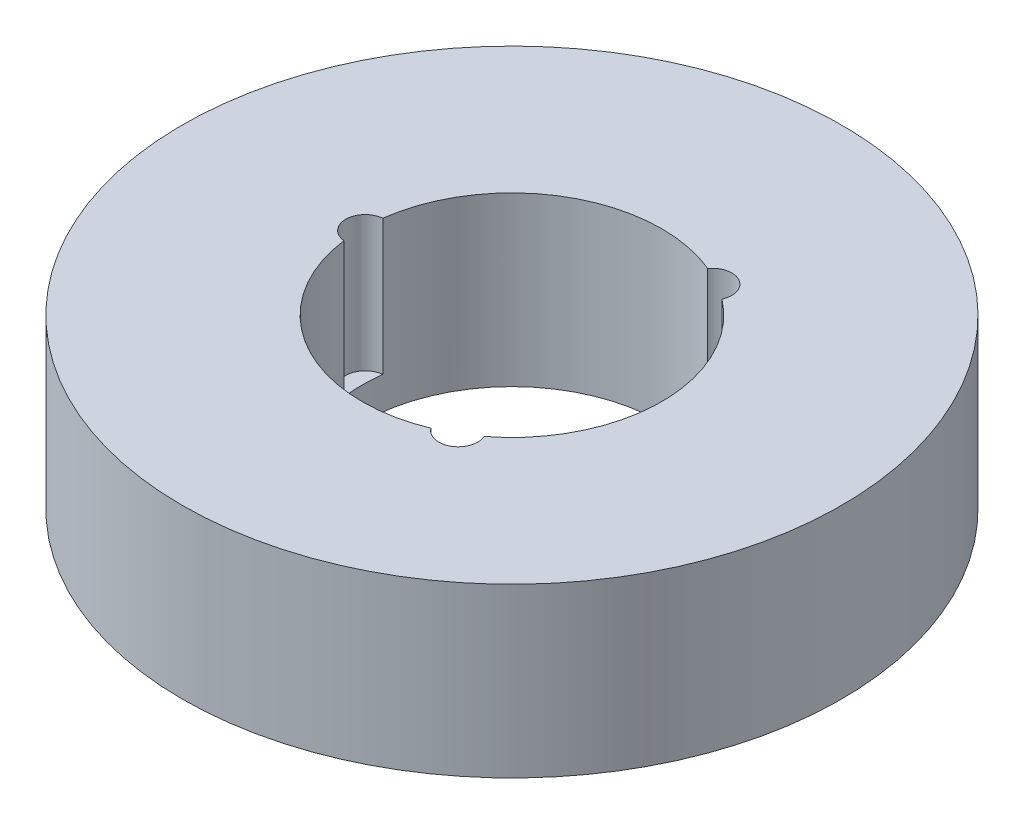
ISO-10303-21;
HEADER;
FILE_DESCRIPTION(('STEP AP214'),'2;1');
FILE_NAME('part.step','',(''),(''),'','','');
FILE_SCHEMA(('AUTOMOTIVE_DESIGN { 1 0 10303 214 1 1 1 1 }'));
ENDSEC;
DATA;
#1=APPLICATION_CONTEXT('core data for automotive mechanical design processes');
#2=APPLICATION_PROTOCOL_DEFINITION('international standard','automotive_design',2000,#1);
#3=PRODUCT_CONTEXT('',#1,'mechanical');
#4=PRODUCT('Part','Part','',(#3));
#5=PRODUCT_RELATED_PRODUCT_CATEGORY('part','',(#4));
#6=PRODUCT_DEFINITION_FORMATION('','',#4);
#7=PRODUCT_DEFINITION_CONTEXT('part definition',#1,'design');
#8=PRODUCT_DEFINITION('design','',#6,#7);
#9=PRODUCT_DEFINITION_SHAPE('','',#8);
#10=(LENGTH_UNIT() NAMED_UNIT(*) SI_UNIT(.MILLI.,.METRE.));
#11=(NAMED_UNIT(*) PLANE_ANGLE_UNIT() SI_UNIT($,.RADIAN.));
#12=(NAMED_UNIT(*) SI_UNIT($,.STERADIAN.) SOLID_ANGLE_UNIT());
#13=UNCERTAINTY_MEASURE_WITH_UNIT(LENGTH_MEASURE(1.E-05),#10,'distance_accuracy_value','');
#14=(GEOMETRIC_REPRESENTATION_CONTEXT(3) GLOBAL_UNCERTAINTY_ASSIGNED_CONTEXT((#13)) GLOBAL_UNIT_ASSIGNED_CONTEXT((#10,
#11,#12)) REPRESENTATION_CONTEXT('',''));
#15=CARTESIAN_POINT('',(0.,0.,0.));
#16=DIRECTION('',(0.,0.,1.));
#17=DIRECTION('',(1.,0.,0.));
#18=AXIS2_PLACEMENT_3D('',#15,#16,#17);
#19=CARTESIAN_POINT('',(0.,28.,0.));
#20=DIRECTION('',(0.,-1.,0.));
#21=DIRECTION('',(0.,0.,-1.));
#22=AXIS2_PLACEMENT_3D('',#19,#20,#21);
#23=CYLINDRICAL_SURFACE('',#22,55.);
#24=CARTESIAN_POINT('',(0.,28.,0.));
#25=DIRECTION('',(0.,1.,0.));
#26=DIRECTION('',(0.,0.,1.));
#27=AXIS2_PLACEMENT_3D('',#24,#25,#26);
#28=CIRCLE('',#27,55.);
#29=CARTESIAN_POINT('',(0.,28.,55.));
#30=VERTEX_POINT('',#29);
#31=EDGE_CURVE('E130',#30,#30,#28,.T.);
#32=ORIENTED_EDGE('',*,*,#31,.F.);
#33=EDGE_LOOP('',(#32));
#34=FACE_BOUND('',#33,.T.);
#35=CARTESIAN_POINT('',(0.,0.,0.));
#36=DIRECTION('',(0.,1.,0.));
#37=DIRECTION('',(0.,0.,1.));
#38=AXIS2_PLACEMENT_3D('',#35,#36,#37);
#39=CIRCLE('',#38,55.);
#40=CARTESIAN_POINT('',(0.,0.,55.));
#41=VERTEX_POINT('',#40);
#42=EDGE_CURVE('E117',#41,#41,#39,.T.);
#43=ORIENTED_EDGE('',*,*,#42,.T.);
#44=EDGE_LOOP('',(#43));
#45=FACE_BOUND('',#44,.T.);
#46=ADVANCED_FACE('F39',(#34,#45),#23,.T.);
#47=CARTESIAN_POINT('',(0.,28.,0.));
#48=DIRECTION('',(0.,1.,0.));
#49=DIRECTION('',(0.,0.,1.));
#50=AXIS2_PLACEMENT_3D('',#47,#48,#49);
#51=PLANE('',#50);
#52=CARTESIAN_POINT('',(12.2413409915985,28.,21.202624550224));
#53=DIRECTION('',(0.,1.,0.));
#54=DIRECTION('',(0.866025403784436,0.,-0.500000000000004));
#55=AXIS2_PLACEMENT_3D('',#52,#53,#54);
#56=CIRCLE('',#55,3.25568479716401);
#57=CARTESIAN_POINT('',(9.58749961336884,28.,23.0885220653825));
#58=VERTEX_POINT('',#57);
#59=CARTESIAN_POINT('',(15.2014968377745,28.,19.847279256642));
#60=VERTEX_POINT('',#59);
#61=EDGE_CURVE('E148',#58,#60,#56,.T.);
#62=ORIENTED_EDGE('',*,*,#61,.F.);
#63=CARTESIAN_POINT('',(0.,28.,0.));
#64=DIRECTION('',(0.,1.,0.));
#65=DIRECTION('',(0.,0.,1.));
#66=AXIS2_PLACEMENT_3D('',#63,#64,#65);
#67=CIRCLE('',#66,25.);
#68=CARTESIAN_POINT('',(-24.7889964511432,28.,3.24124280874044));
#69=VERTEX_POINT('',#68);
#70=EDGE_CURVE('E113',#69,#58,#67,.T.);
#71=ORIENTED_EDGE('',*,*,#70,.F.);
#72=CARTESIAN_POINT('',(-24.4826819831968,28.,0.));
#73=DIRECTION('',(0.,1.,0.));
#74=DIRECTION('',(0.,0.,1.));
#75=AXIS2_PLACEMENT_3D('',#72,#73,#74);
#76=CIRCLE('',#75,3.25568479716401);
#77=CARTESIAN_POINT('',(-24.7889964511432,28.,-3.24124280874044));
#78=VERTEX_POINT('',#77);
#79=EDGE_CURVE('E125',#78,#69,#76,.T.);
#80=ORIENTED_EDGE('',*,*,#79,.F.);
#81=CARTESIAN_POINT('',(9.58749961336852,28.,-23.0885220653826));
#82=VERTEX_POINT('',#81);
#83=EDGE_CURVE('E107',#82,#78,#67,.T.);
#84=ORIENTED_EDGE('',*,*,#83,.F.);
#85=CARTESIAN_POINT('',(12.2413409915982,28.,-21.2026245502242));
#86=DIRECTION('',(0.,1.,0.));
#87=DIRECTION('',(-0.866025403784443,0.,-0.499999999999992));
#88=AXIS2_PLACEMENT_3D('',#85,#86,#87);
#89=CIRCLE('',#88,3.25568479716401);
#90=CARTESIAN_POINT('',(15.2014968377742,28.,-19.8472792566422));
#91=VERTEX_POINT('',#90);
#92=EDGE_CURVE('E95',#91,#82,#89,.T.);
#93=ORIENTED_EDGE('',*,*,#92,.F.);
#94=EDGE_CURVE('E106',#60,#91,#67,.T.);
#95=ORIENTED_EDGE('',*,*,#94,.F.);
#96=EDGE_LOOP('',(#62,#71,#80,#84,#93,#95));
#97=FACE_BOUND('',#96,.T.);
#98=ORIENTED_EDGE('',*,*,#31,.T.);
#99=EDGE_LOOP('',(#98));
#100=FACE_BOUND('',#99,.T.);
#101=ADVANCED_FACE('F102',(#97,#100),#51,.T.);
#102=CARTESIAN_POINT('',(0.,0.,0.));
#103=DIRECTION('',(0.,1.,0.));
#104=DIRECTION('',(0.,0.,1.));
#105=AXIS2_PLACEMENT_3D('',#102,#103,#104);
#106=PLANE('',#105);
#107=CARTESIAN_POINT('',(0.,0.,0.));
#108=DIRECTION('',(0.,1.,0.));
#109=DIRECTION('',(0.,0.,1.));
#110=AXIS2_PLACEMENT_3D('',#107,#108,#109);
#111=CIRCLE('',#110,25.);
#112=CARTESIAN_POINT('',(0.,0.,25.));
#113=VERTEX_POINT('',#112);
#114=EDGE_CURVE('E118',#113,#113,#111,.T.);
#115=ORIENTED_EDGE('',*,*,#114,.T.);
#116=EDGE_LOOP('',(#115));
#117=FACE_BOUND('',#116,.T.);
#118=ORIENTED_EDGE('',*,*,#42,.F.);
#119=EDGE_LOOP('',(#118));
#120=FACE_BOUND('',#119,.T.);
#121=ADVANCED_FACE('F161',(#117,#120),#106,.F.);
#122=CARTESIAN_POINT('',(0.,28.,0.));
#123=DIRECTION('',(0.,-1.,0.));
#124=DIRECTION('',(0.,0.,-1.));
#125=AXIS2_PLACEMENT_3D('',#122,#123,#124);
#126=CYLINDRICAL_SURFACE('',#125,25.);
#127=DIRECTION('',(0.,1.,0.));
#128=VECTOR('',#127,1.);
#129=CARTESIAN_POINT('',(9.58749961336884,16.7095679106865,23.0885220653825));
#130=LINE('',#129,#128);
#131=CARTESIAN_POINT('',(9.58749961336884,5.41913582137293,23.0885220653825));
#132=VERTEX_POINT('',#131);
#133=EDGE_CURVE('E11',#132,#58,#130,.T.);
#134=ORIENTED_EDGE('',*,*,#133,.F.);
#135=CARTESIAN_POINT('',(0.,5.41913582137293,0.));
#136=DIRECTION('',(0.,1.,0.));
#137=DIRECTION('',(0.,0.,1.));
#138=AXIS2_PLACEMENT_3D('',#135,#136,#137);
#139=CIRCLE('',#138,25.);
#140=CARTESIAN_POINT('',(15.2014968377745,5.41913582137293,19.847279256642));
#141=VERTEX_POINT('',#140);
#142=EDGE_CURVE('E100',#132,#141,#139,.T.);
#143=ORIENTED_EDGE('',*,*,#142,.T.);
#144=DIRECTION('',(0.,1.,0.));
#145=VECTOR('',#144,1.);
#146=CARTESIAN_POINT('',(15.2014968377745,16.7095679106865,19.847279256642));
#147=LINE('',#146,#145);
#148=EDGE_CURVE('E46',#60,#141,#147,.F.);
#149=ORIENTED_EDGE('',*,*,#148,.F.);
#150=ORIENTED_EDGE('',*,*,#94,.T.);
#151=DIRECTION('',(0.,1.,0.));
#152=VECTOR('',#151,1.);
#153=CARTESIAN_POINT('',(15.2014968377742,16.7095679106865,-19.8472792566422));
#154=LINE('',#153,#152);
#155=CARTESIAN_POINT('',(15.2014968377742,5.41913582137293,-19.8472792566422));
#156=VERTEX_POINT('',#155);
#157=EDGE_CURVE('E90',#156,#91,#154,.T.);
#158=ORIENTED_EDGE('',*,*,#157,.F.);
#159=CARTESIAN_POINT('',(0.,5.41913582137293,0.));
#160=DIRECTION('',(0.,1.,0.));
#161=DIRECTION('',(0.,0.,1.));
#162=AXIS2_PLACEMENT_3D('',#159,#160,#161);
#163=CIRCLE('',#162,25.);
#164=CARTESIAN_POINT('',(9.58749961336852,5.41913582137293,-23.0885220653826));
#165=VERTEX_POINT('',#164);
#166=EDGE_CURVE('E143',#156,#165,#163,.T.);
#167=ORIENTED_EDGE('',*,*,#166,.T.);
#168=DIRECTION('',(0.,1.,0.));
#169=VECTOR('',#168,1.);
#170=CARTESIAN_POINT('',(9.58749961336852,16.7095679106865,-23.0885220653826));
#171=LINE('',#170,#169);
#172=EDGE_CURVE('E98',#82,#165,#171,.F.);
#173=ORIENTED_EDGE('',*,*,#172,.F.);
#174=ORIENTED_EDGE('',*,*,#83,.T.);
#175=DIRECTION('',(0.,1.,0.));
#176=VECTOR('',#175,1.);
#177=CARTESIAN_POINT('',(-24.7889964511432,16.7095679106865,-3.24124280874044));
#178=LINE('',#177,#176);
#179=CARTESIAN_POINT('',(-24.7889964511432,5.41913582137293,-3.24124280874044));
#180=VERTEX_POINT('',#179);
#181=EDGE_CURVE('E137',#180,#78,#178,.T.);
#182=ORIENTED_EDGE('',*,*,#181,.F.);
#183=CARTESIAN_POINT('',(0.,5.41913582137293,0.));
#184=DIRECTION('',(0.,1.,0.));
#185=DIRECTION('',(0.,0.,1.));
#186=AXIS2_PLACEMENT_3D('',#183,#184,#185);
#187=CIRCLE('',#186,25.);
#188=CARTESIAN_POINT('',(-24.7889964511432,5.41913582137293,3.24124280874044));
#189=VERTEX_POINT('',#188);
#190=EDGE_CURVE('E128',#180,#189,#187,.T.);
#191=ORIENTED_EDGE('',*,*,#190,.T.);
#192=DIRECTION('',(0.,1.,0.));
#193=VECTOR('',#192,1.);
#194=CARTESIAN_POINT('',(-24.7889964511432,16.7095679106865,3.24124280874044));
#195=LINE('',#194,#193);
#196=EDGE_CURVE('E134',#69,#189,#195,.F.);
#197=ORIENTED_EDGE('',*,*,#196,.F.);
#198=ORIENTED_EDGE('',*,*,#70,.T.);
#199=EDGE_LOOP('',(#134,#143,#149,#150,#158,#167,#173,#174,#182,#191,#197,#198));
#200=FACE_BOUND('',#199,.T.);
#201=ORIENTED_EDGE('',*,*,#114,.F.);
#202=EDGE_LOOP('',(#201));
#203=FACE_BOUND('',#202,.T.);
#204=ADVANCED_FACE('F115',(#200,#203),#126,.F.);
#205=CARTESIAN_POINT('',(-24.4826819831968,5.41913582137293,0.));
#206=DIRECTION('',(0.,1.,0.));
#207=DIRECTION('',(0.,0.,1.));
#208=AXIS2_PLACEMENT_3D('',#205,#206,#207);
#209=CYLINDRICAL_SURFACE('',#208,3.25568479716401);
#210=ORIENTED_EDGE('',*,*,#181,.T.);
#211=ORIENTED_EDGE('',*,*,#79,.T.);
#212=ORIENTED_EDGE('',*,*,#196,.T.);
#213=CARTESIAN_POINT('',(-24.4826819831968,5.41913582137293,0.));
#214=DIRECTION('',(0.,1.,0.));
#215=DIRECTION('',(0.,0.,1.));
#216=AXIS2_PLACEMENT_3D('',#213,#214,#215);
#217=CIRCLE('',#216,3.25568479716401);
#218=EDGE_CURVE('E127',#180,#189,#217,.T.);
#219=ORIENTED_EDGE('',*,*,#218,.F.);
#220=EDGE_LOOP('',(#210,#211,#212,#219));
#221=FACE_BOUND('',#220,.T.);
#222=ADVANCED_FACE('F175',(#221),#209,.F.);
#223=CARTESIAN_POINT('',(-24.4826819831968,5.41913582137293,0.));
#224=DIRECTION('',(0.,1.,0.));
#225=DIRECTION('',(0.,0.,1.));
#226=AXIS2_PLACEMENT_3D('',#223,#224,#225);
#227=PLANE('',#226);
#228=ORIENTED_EDGE('',*,*,#218,.T.);
#229=ORIENTED_EDGE('',*,*,#190,.F.);
#230=EDGE_LOOP('',(#228,#229));
#231=FACE_BOUND('',#230,.T.);
#232=ADVANCED_FACE('F176',(#231),#227,.T.);
#233=CARTESIAN_POINT('',(12.2413409915982,5.41913582137293,-21.2026245502242));
#234=DIRECTION('',(0.,1.,0.));
#235=DIRECTION('',(0.,0.,1.));
#236=AXIS2_PLACEMENT_3D('',#233,#234,#235);
#237=CYLINDRICAL_SURFACE('',#236,3.25568479716401);
#238=ORIENTED_EDGE('',*,*,#157,.T.);
#239=ORIENTED_EDGE('',*,*,#92,.T.);
#240=ORIENTED_EDGE('',*,*,#172,.T.);
#241=CARTESIAN_POINT('',(12.2413409915982,5.41913582137293,-21.2026245502242));
#242=DIRECTION('',(0.,1.,0.));
#243=DIRECTION('',(-0.866025403784443,0.,-0.499999999999992));
#244=AXIS2_PLACEMENT_3D('',#241,#242,#243);
#245=CIRCLE('',#244,3.25568479716401);
#246=EDGE_CURVE('E56',#156,#165,#245,.T.);
#247=ORIENTED_EDGE('',*,*,#246,.F.);
#248=EDGE_LOOP('',(#238,#239,#240,#247));
#249=FACE_BOUND('',#248,.T.);
#250=ADVANCED_FACE('F93',(#249),#237,.F.);
#251=CARTESIAN_POINT('',(12.2413409915982,5.41913582137293,-21.2026245502242));
#252=DIRECTION('',(0.,1.,0.));
#253=DIRECTION('',(-0.866025403784443,0.,-0.499999999999992));
#254=AXIS2_PLACEMENT_3D('',#251,#252,#253);
#255=PLANE('',#254);
#256=ORIENTED_EDGE('',*,*,#246,.T.);
#257=ORIENTED_EDGE('',*,*,#166,.F.);
#258=EDGE_LOOP('',(#256,#257));
#259=FACE_BOUND('',#258,.T.);
#260=ADVANCED_FACE('F153',(#259),#255,.T.);
#261=CARTESIAN_POINT('',(12.2413409915985,5.41913582137293,21.202624550224));
#262=DIRECTION('',(0.,1.,0.));
#263=DIRECTION('',(0.,0.,1.));
#264=AXIS2_PLACEMENT_3D('',#261,#262,#263);
#265=CYLINDRICAL_SURFACE('',#264,3.25568479716401);
#266=ORIENTED_EDGE('',*,*,#133,.T.);
#267=ORIENTED_EDGE('',*,*,#61,.T.);
#268=ORIENTED_EDGE('',*,*,#148,.T.);
#269=CARTESIAN_POINT('',(12.2413409915985,5.41913582137293,21.202624550224));
#270=DIRECTION('',(0.,1.,0.));
#271=DIRECTION('',(0.866025403784436,0.,-0.500000000000004));
#272=AXIS2_PLACEMENT_3D('',#269,#270,#271);
#273=CIRCLE('',#272,3.25568479716401);
#274=EDGE_CURVE('E55',#132,#141,#273,.T.);
#275=ORIENTED_EDGE('',*,*,#274,.F.);
#276=EDGE_LOOP('',(#266,#267,#268,#275));
#277=FACE_BOUND('',#276,.T.);
#278=ADVANCED_FACE('F144',(#277),#265,.F.);
#279=CARTESIAN_POINT('',(12.2413409915985,5.41913582137293,21.202624550224));
#280=DIRECTION('',(0.,1.,0.));
#281=DIRECTION('',(0.866025403784436,0.,-0.500000000000004));
#282=AXIS2_PLACEMENT_3D('',#279,#280,#281);
#283=PLANE('',#282);
#284=ORIENTED_EDGE('',*,*,#274,.T.);
#285=ORIENTED_EDGE('',*,*,#142,.F.);
#286=EDGE_LOOP('',(#284,#285));
#287=FACE_BOUND('',#286,.T.);
#288=ADVANCED_FACE('F150',(#287),#283,.T.);
#289=CLOSED_SHELL('',(#46,#101,#121,#204,#222,#232,#250,#260,#278,#288));
#290=MANIFOLD_SOLID_BREP('B2',#289);
#291=ADVANCED_BREP_SHAPE_REPRESENTATION('',(#18,#290),#14);
#292=SHAPE_DEFINITION_REPRESENTATION(#9,#291);
ENDSEC;
END-ISO-10303-21;
